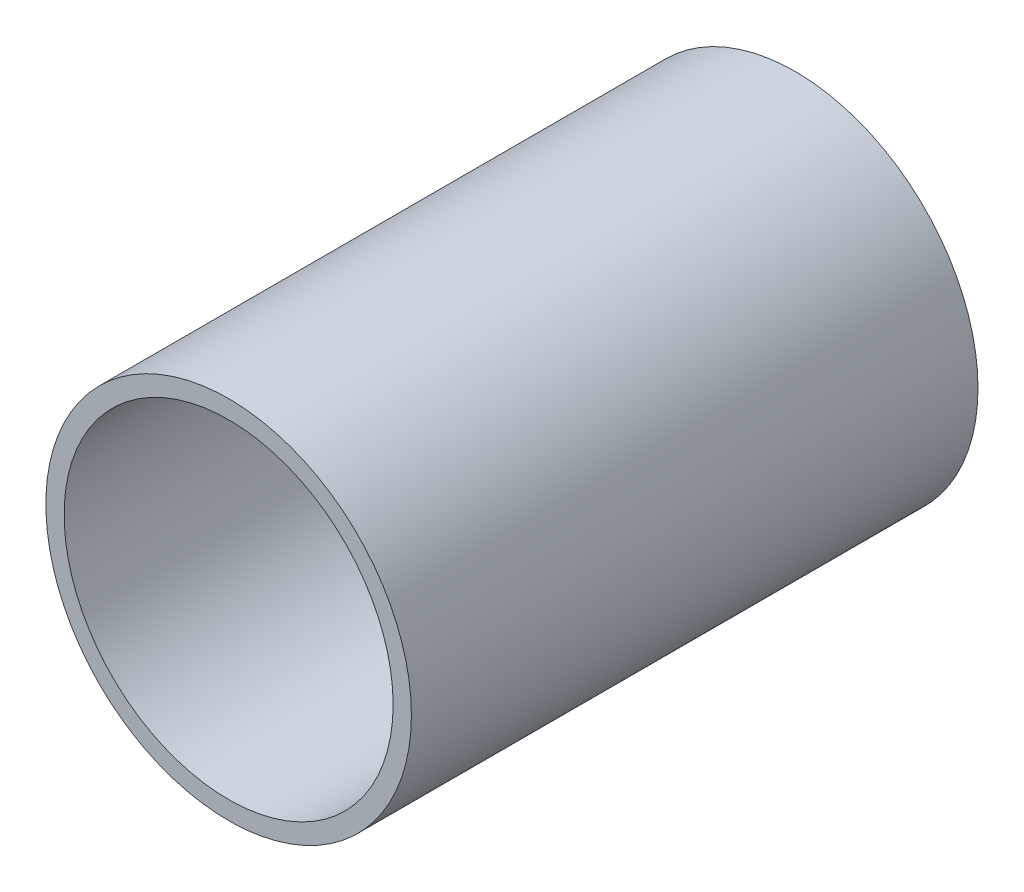
ISO-10303-21;
HEADER;
FILE_DESCRIPTION(('STEP AP214'),'2;1');
FILE_NAME('part.step','',(''),(''),'','','');
FILE_SCHEMA(('AUTOMOTIVE_DESIGN { 1 0 10303 214 1 1 1 1 }'));
ENDSEC;
DATA;
#1=APPLICATION_CONTEXT('core data for automotive mechanical design processes');
#2=APPLICATION_PROTOCOL_DEFINITION('international standard','automotive_design',2000,#1);
#3=PRODUCT_CONTEXT('',#1,'mechanical');
#4=PRODUCT('Part','Part','',(#3));
#5=PRODUCT_RELATED_PRODUCT_CATEGORY('part','',(#4));
#6=PRODUCT_DEFINITION_FORMATION('','',#4);
#7=PRODUCT_DEFINITION_CONTEXT('part definition',#1,'design');
#8=PRODUCT_DEFINITION('design','',#6,#7);
#9=PRODUCT_DEFINITION_SHAPE('','',#8);
#10=(LENGTH_UNIT() NAMED_UNIT(*) SI_UNIT(.MILLI.,.METRE.));
#11=(NAMED_UNIT(*) PLANE_ANGLE_UNIT() SI_UNIT($,.RADIAN.));
#12=(NAMED_UNIT(*) SI_UNIT($,.STERADIAN.) SOLID_ANGLE_UNIT());
#13=UNCERTAINTY_MEASURE_WITH_UNIT(LENGTH_MEASURE(1.E-05),#10,'distance_accuracy_value','');
#14=(GEOMETRIC_REPRESENTATION_CONTEXT(3) GLOBAL_UNCERTAINTY_ASSIGNED_CONTEXT((#13)) GLOBAL_UNIT_ASSIGNED_CONTEXT((#10,
#11,#12)) REPRESENTATION_CONTEXT('',''));
#15=CARTESIAN_POINT('',(0.,0.,0.));
#16=DIRECTION('',(0.,0.,1.));
#17=DIRECTION('',(1.,0.,0.));
#18=AXIS2_PLACEMENT_3D('',#15,#16,#17);
#19=CARTESIAN_POINT('',(0.,0.,31.));
#20=DIRECTION('',(0.,0.,1.));
#21=DIRECTION('',(1.,0.,0.));
#22=AXIS2_PLACEMENT_3D('',#19,#20,#21);
#23=PLANE('',#22);
#24=CARTESIAN_POINT('',(0.,0.,31.));
#25=DIRECTION('',(0.,0.,1.));
#26=DIRECTION('',(1.,0.,0.));
#27=AXIS2_PLACEMENT_3D('',#24,#25,#26);
#28=CIRCLE('',#27,10.);
#29=CARTESIAN_POINT('',(10.,0.,31.));
#30=VERTEX_POINT('',#29);
#31=EDGE_CURVE('E10',#30,#30,#28,.T.);
#32=ORIENTED_EDGE('',*,*,#31,.T.);
#33=EDGE_LOOP('',(#32));
#34=FACE_BOUND('',#33,.T.);
#35=CARTESIAN_POINT('',(0.,0.,31.));
#36=DIRECTION('',(0.,0.,1.));
#37=DIRECTION('',(1.,0.,0.));
#38=AXIS2_PLACEMENT_3D('',#35,#36,#37);
#39=CIRCLE('',#38,9.);
#40=CARTESIAN_POINT('',(9.,0.,31.));
#41=VERTEX_POINT('',#40);
#42=EDGE_CURVE('E43',#41,#41,#39,.T.);
#43=ORIENTED_EDGE('',*,*,#42,.F.);
#44=EDGE_LOOP('',(#43));
#45=FACE_BOUND('',#44,.T.);
#46=ADVANCED_FACE('F32',(#34,#45),#23,.T.);
#47=CARTESIAN_POINT('',(0.,0.,0.));
#48=DIRECTION('',(0.,0.,1.));
#49=DIRECTION('',(1.,0.,0.));
#50=AXIS2_PLACEMENT_3D('',#47,#48,#49);
#51=PLANE('',#50);
#52=CARTESIAN_POINT('',(0.,0.,0.));
#53=DIRECTION('',(0.,0.,1.));
#54=DIRECTION('',(1.,0.,0.));
#55=AXIS2_PLACEMENT_3D('',#52,#53,#54);
#56=CIRCLE('',#55,10.);
#57=CARTESIAN_POINT('',(10.,0.,0.));
#58=VERTEX_POINT('',#57);
#59=EDGE_CURVE('E36',#58,#58,#56,.T.);
#60=ORIENTED_EDGE('',*,*,#59,.F.);
#61=EDGE_LOOP('',(#60));
#62=FACE_BOUND('',#61,.T.);
#63=CARTESIAN_POINT('',(0.,0.,0.));
#64=DIRECTION('',(0.,0.,1.));
#65=DIRECTION('',(1.,0.,0.));
#66=AXIS2_PLACEMENT_3D('',#63,#64,#65);
#67=CIRCLE('',#66,9.);
#68=CARTESIAN_POINT('',(9.,0.,0.));
#69=VERTEX_POINT('',#68);
#70=EDGE_CURVE('E45',#69,#69,#67,.T.);
#71=ORIENTED_EDGE('',*,*,#70,.T.);
#72=EDGE_LOOP('',(#71));
#73=FACE_BOUND('',#72,.T.);
#74=ADVANCED_FACE('F55',(#62,#73),#51,.F.);
#75=CARTESIAN_POINT('',(0.,0.,31.));
#76=DIRECTION('',(0.,0.,-1.));
#77=DIRECTION('',(-1.,0.,0.));
#78=AXIS2_PLACEMENT_3D('',#75,#76,#77);
#79=CYLINDRICAL_SURFACE('',#78,10.);
#80=ORIENTED_EDGE('',*,*,#31,.F.);
#81=EDGE_LOOP('',(#80));
#82=FACE_BOUND('',#81,.T.);
#83=ORIENTED_EDGE('',*,*,#59,.T.);
#84=EDGE_LOOP('',(#83));
#85=FACE_BOUND('',#84,.T.);
#86=ADVANCED_FACE('F34',(#82,#85),#79,.T.);
#87=CARTESIAN_POINT('',(0.,0.,31.));
#88=DIRECTION('',(0.,0.,-1.));
#89=DIRECTION('',(-1.,0.,0.));
#90=AXIS2_PLACEMENT_3D('',#87,#88,#89);
#91=CYLINDRICAL_SURFACE('',#90,9.);
#92=ORIENTED_EDGE('',*,*,#42,.T.);
#93=EDGE_LOOP('',(#92));
#94=FACE_BOUND('',#93,.T.);
#95=ORIENTED_EDGE('',*,*,#70,.F.);
#96=EDGE_LOOP('',(#95));
#97=FACE_BOUND('',#96,.T.);
#98=ADVANCED_FACE('F51',(#94,#97),#91,.F.);
#99=CLOSED_SHELL('',(#46,#74,#86,#98));
#100=MANIFOLD_SOLID_BREP('B2',#99);
#101=ADVANCED_BREP_SHAPE_REPRESENTATION('',(#18,#100),#14);
#102=SHAPE_DEFINITION_REPRESENTATION(#9,#101);
ENDSEC;
END-ISO-10303-21;
